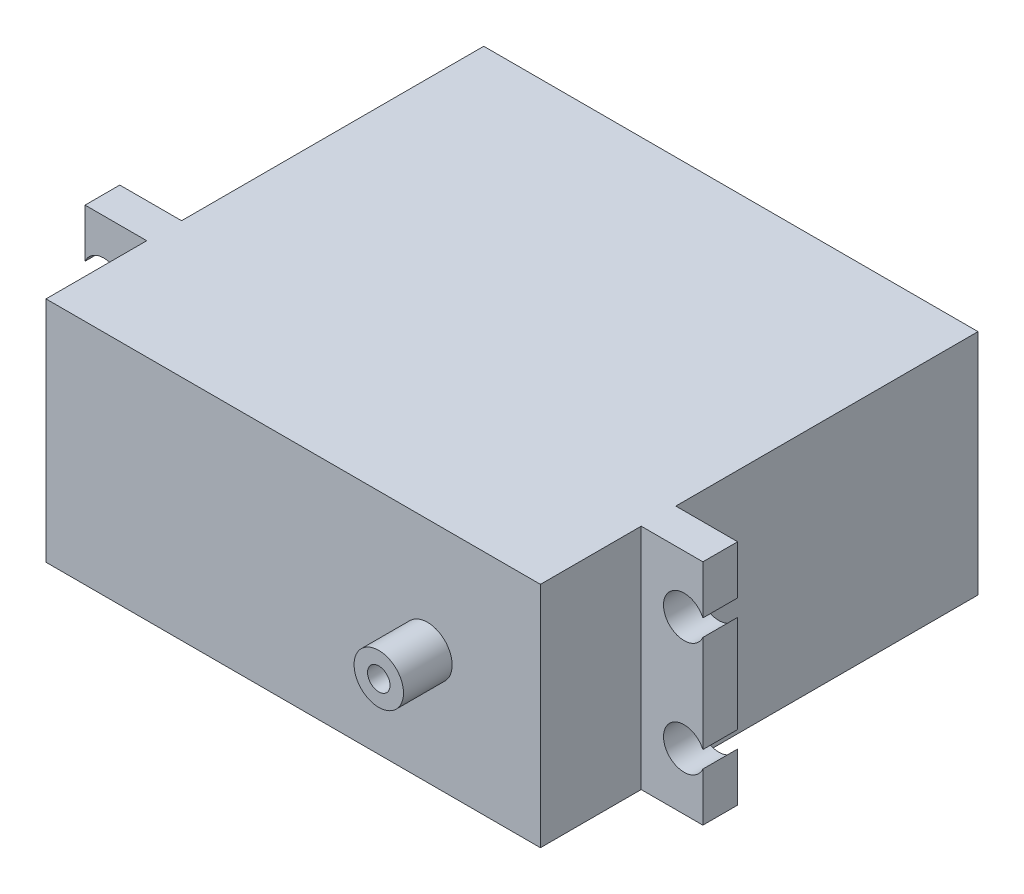
ISO-10303-21;
HEADER;
FILE_DESCRIPTION(('STEP AP214'),'2;1');
FILE_NAME('part.step','',(''),(''),'','','');
FILE_SCHEMA(('AUTOMOTIVE_DESIGN { 1 0 10303 214 1 1 1 1 }'));
ENDSEC;
DATA;
#1=APPLICATION_CONTEXT('core data for automotive mechanical design processes');
#2=APPLICATION_PROTOCOL_DEFINITION('international standard','automotive_design',2000,#1);
#3=PRODUCT_CONTEXT('',#1,'mechanical');
#4=PRODUCT('Part','Part','',(#3));
#5=PRODUCT_RELATED_PRODUCT_CATEGORY('part','',(#4));
#6=PRODUCT_DEFINITION_FORMATION('','',#4);
#7=PRODUCT_DEFINITION_CONTEXT('part definition',#1,'design');
#8=PRODUCT_DEFINITION('design','',#6,#7);
#9=PRODUCT_DEFINITION_SHAPE('','',#8);
#10=(LENGTH_UNIT() NAMED_UNIT(*) SI_UNIT(.MILLI.,.METRE.));
#11=(NAMED_UNIT(*) PLANE_ANGLE_UNIT() SI_UNIT($,.RADIAN.));
#12=(NAMED_UNIT(*) SI_UNIT($,.STERADIAN.) SOLID_ANGLE_UNIT());
#13=UNCERTAINTY_MEASURE_WITH_UNIT(LENGTH_MEASURE(1.E-05),#10,'distance_accuracy_value','');
#14=(GEOMETRIC_REPRESENTATION_CONTEXT(3) GLOBAL_UNCERTAINTY_ASSIGNED_CONTEXT((#13)) GLOBAL_UNIT_ASSIGNED_CONTEXT((#10,
#11,#12)) REPRESENTATION_CONTEXT('',''));
#15=CARTESIAN_POINT('',(0.,0.,0.));
#16=DIRECTION('',(0.,0.,1.));
#17=DIRECTION('',(1.,0.,0.));
#18=AXIS2_PLACEMENT_3D('',#15,#16,#17);
#19=CARTESIAN_POINT('',(0.,0.,45.0154));
#20=DIRECTION('',(0.,0.,1.));
#21=DIRECTION('',(1.,0.,0.));
#22=AXIS2_PLACEMENT_3D('',#19,#20,#21);
#23=PLANE('',#22);
#24=DIRECTION('',(0.,-1.,0.));
#25=VECTOR('',#24,1.);
#26=CARTESIAN_POINT('',(-33.03236,-15.24,45.0154));
#27=LINE('',#26,#25);
#28=CARTESIAN_POINT('',(-33.03236,15.24,45.0154));
#29=VERTEX_POINT('',#28);
#30=CARTESIAN_POINT('',(-33.03236,-15.24,45.0154));
#31=VERTEX_POINT('',#30);
#32=EDGE_CURVE('E194',#29,#31,#27,.T.);
#33=ORIENTED_EDGE('',*,*,#32,.F.);
#34=DIRECTION('',(-1.,0.,0.));
#35=VECTOR('',#34,1.);
#36=CARTESIAN_POINT('',(0.,15.24,45.0154));
#37=LINE('',#36,#35);
#38=CARTESIAN_POINT('',(-41.275,15.24,45.0154));
#39=VERTEX_POINT('',#38);
#40=EDGE_CURVE('E472',#29,#39,#37,.T.);
#41=ORIENTED_EDGE('',*,*,#40,.T.);
#42=DIRECTION('',(0.,1.,0.));
#43=VECTOR('',#42,1.);
#44=CARTESIAN_POINT('',(-41.275,0.,45.0154));
#45=LINE('',#44,#43);
#46=CARTESIAN_POINT('',(-41.275,8.74168445002051,45.0154));
#47=VERTEX_POINT('',#46);
#48=EDGE_CURVE('E480',#47,#39,#45,.T.);
#49=ORIENTED_EDGE('',*,*,#48,.F.);
#50=CARTESIAN_POINT('',(-38.76612,7.61562,45.0154));
#51=DIRECTION('',(0.,0.,1.));
#52=DIRECTION('',(1.,0.,0.));
#53=AXIS2_PLACEMENT_3D('',#50,#51,#52);
#54=CIRCLE('',#53,2.75);
#55=CARTESIAN_POINT('',(-41.275,6.48955554997949,45.0154));
#56=VERTEX_POINT('',#55);
#57=EDGE_CURVE('E492',#47,#56,#54,.F.);
#58=ORIENTED_EDGE('',*,*,#57,.T.);
#59=DIRECTION('',(0.,-1.,0.));
#60=VECTOR('',#59,1.);
#61=CARTESIAN_POINT('',(-41.275,0.,45.0154));
#62=LINE('',#61,#60);
#63=CARTESIAN_POINT('',(-41.275,-6.48955554997949,45.0154));
#64=VERTEX_POINT('',#63);
#65=EDGE_CURVE('E494',#56,#64,#62,.T.);
#66=ORIENTED_EDGE('',*,*,#65,.T.);
#67=CARTESIAN_POINT('',(-38.76612,-7.61562,45.0154));
#68=DIRECTION('',(0.,0.,1.));
#69=DIRECTION('',(1.,0.,0.));
#70=AXIS2_PLACEMENT_3D('',#67,#68,#69);
#71=CIRCLE('',#70,2.75);
#72=CARTESIAN_POINT('',(-41.275,-8.74168445002051,45.0154));
#73=VERTEX_POINT('',#72);
#74=EDGE_CURVE('E496',#73,#64,#71,.T.);
#75=ORIENTED_EDGE('',*,*,#74,.F.);
#76=DIRECTION('',(0.,-1.,0.));
#77=VECTOR('',#76,1.);
#78=CARTESIAN_POINT('',(-41.275,0.,45.0154));
#79=LINE('',#78,#77);
#80=CARTESIAN_POINT('',(-41.275,-15.24,45.0154));
#81=VERTEX_POINT('',#80);
#82=EDGE_CURVE('E499',#73,#81,#79,.T.);
#83=ORIENTED_EDGE('',*,*,#82,.T.);
#84=DIRECTION('',(-1.,0.,0.));
#85=VECTOR('',#84,1.);
#86=CARTESIAN_POINT('',(0.,-15.24,45.0154));
#87=LINE('',#86,#85);
#88=EDGE_CURVE('E50',#31,#81,#87,.T.);
#89=ORIENTED_EDGE('',*,*,#88,.F.);
#90=EDGE_LOOP('',(#33,#41,#49,#58,#66,#75,#83,#89));
#91=FACE_BOUND('',#90,.T.);
#92=ADVANCED_FACE('F35',(#91),#23,.T.);
#93=CARTESIAN_POINT('',(-33.02,-15.24,40.3754));
#94=DIRECTION('',(1.,0.,0.));
#95=DIRECTION('',(0.,0.,-1.));
#96=AXIS2_PLACEMENT_3D('',#93,#94,#95);
#97=PLANE('',#96);
#98=DIRECTION('',(0.,-1.,0.));
#99=VECTOR('',#98,1.);
#100=CARTESIAN_POINT('',(-33.02,-15.24,0.));
#101=LINE('',#100,#99);
#102=CARTESIAN_POINT('',(-33.02,15.24,0.));
#103=VERTEX_POINT('',#102);
#104=CARTESIAN_POINT('',(-33.02,-15.24,0.));
#105=VERTEX_POINT('',#104);
#106=EDGE_CURVE('E560',#103,#105,#101,.T.);
#107=ORIENTED_EDGE('',*,*,#106,.T.);
#108=DIRECTION('',(0.,0.,-1.));
#109=VECTOR('',#108,1.);
#110=CARTESIAN_POINT('',(-33.02,-15.24,40.3754));
#111=LINE('',#110,#109);
#112=CARTESIAN_POINT('',(-33.02,-15.24,40.3754));
#113=VERTEX_POINT('',#112);
#114=EDGE_CURVE('E43',#113,#105,#111,.T.);
#115=ORIENTED_EDGE('',*,*,#114,.F.);
#116=DIRECTION('',(0.,-1.,0.));
#117=VECTOR('',#116,1.);
#118=CARTESIAN_POINT('',(-33.02,-15.24,40.3754));
#119=LINE('',#118,#117);
#120=CARTESIAN_POINT('',(-33.02,15.24,40.3754));
#121=VERTEX_POINT('',#120);
#122=EDGE_CURVE('E576',#121,#113,#119,.T.);
#123=ORIENTED_EDGE('',*,*,#122,.F.);
#124=DIRECTION('',(0.,0.,-1.));
#125=VECTOR('',#124,1.);
#126=CARTESIAN_POINT('',(-33.02,15.24,40.3754));
#127=LINE('',#126,#125);
#128=EDGE_CURVE('E581',#121,#103,#127,.T.);
#129=ORIENTED_EDGE('',*,*,#128,.T.);
#130=EDGE_LOOP('',(#107,#115,#123,#129));
#131=FACE_BOUND('',#130,.T.);
#132=ADVANCED_FACE('F37',(#131),#97,.F.);
#133=CARTESIAN_POINT('',(33.02,-15.24,40.3754));
#134=DIRECTION('',(0.,1.,0.));
#135=DIRECTION('',(-1.,0.,0.));
#136=AXIS2_PLACEMENT_3D('',#133,#134,#135);
#137=PLANE('',#136);
#138=DIRECTION('',(1.,0.,0.));
#139=VECTOR('',#138,1.);
#140=CARTESIAN_POINT('',(33.02,-15.24,0.));
#141=LINE('',#140,#139);
#142=CARTESIAN_POINT('',(33.02,-15.24,0.));
#143=VERTEX_POINT('',#142);
#144=EDGE_CURVE('E564',#105,#143,#141,.T.);
#145=ORIENTED_EDGE('',*,*,#144,.T.);
#146=DIRECTION('',(0.,0.,-1.));
#147=VECTOR('',#146,1.);
#148=CARTESIAN_POINT('',(33.02,-15.24,40.3754));
#149=LINE('',#148,#147);
#150=CARTESIAN_POINT('',(33.02,-15.24,40.3754));
#151=VERTEX_POINT('',#150);
#152=EDGE_CURVE('E580',#151,#143,#149,.T.);
#153=ORIENTED_EDGE('',*,*,#152,.F.);
#154=DIRECTION('',(-1.,0.,0.));
#155=VECTOR('',#154,1.);
#156=CARTESIAN_POINT('',(0.,-15.24,40.3754));
#157=LINE('',#156,#155);
#158=CARTESIAN_POINT('',(41.275,-15.24,40.3754));
#159=VERTEX_POINT('',#158);
#160=EDGE_CURVE('E528',#159,#151,#157,.T.);
#161=ORIENTED_EDGE('',*,*,#160,.F.);
#162=DIRECTION('',(0.,0.,-1.));
#163=VECTOR('',#162,1.);
#164=CARTESIAN_POINT('',(41.275,-15.24,45.0154));
#165=LINE('',#164,#163);
#166=CARTESIAN_POINT('',(41.275,-15.24,45.0154));
#167=VERTEX_POINT('',#166);
#168=EDGE_CURVE('E535',#167,#159,#165,.T.);
#169=ORIENTED_EDGE('',*,*,#168,.F.);
#170=CARTESIAN_POINT('',(33.03236,-15.24,45.0154));
#171=VERTEX_POINT('',#170);
#172=EDGE_CURVE('E486',#167,#171,#87,.T.);
#173=ORIENTED_EDGE('',*,*,#172,.T.);
#174=DIRECTION('',(0.,0.,-1.));
#175=VECTOR('',#174,1.);
#176=CARTESIAN_POINT('',(33.03236,-15.24,58.4774));
#177=LINE('',#176,#175);
#178=CARTESIAN_POINT('',(33.03236,-15.24,58.4774));
#179=VERTEX_POINT('',#178);
#180=EDGE_CURVE('E179',#179,#171,#177,.T.);
#181=ORIENTED_EDGE('',*,*,#180,.F.);
#182=DIRECTION('',(1.,0.,0.));
#183=VECTOR('',#182,1.);
#184=CARTESIAN_POINT('',(33.03236,-15.24,58.4774));
#185=LINE('',#184,#183);
#186=CARTESIAN_POINT('',(-33.03236,-15.24,58.4774));
#187=VERTEX_POINT('',#186);
#188=EDGE_CURVE('E172',#187,#179,#185,.T.);
#189=ORIENTED_EDGE('',*,*,#188,.F.);
#190=DIRECTION('',(0.,0.,-1.));
#191=VECTOR('',#190,1.);
#192=CARTESIAN_POINT('',(-33.03236,-15.24,58.4774));
#193=LINE('',#192,#191);
#194=EDGE_CURVE('E176',#187,#31,#193,.T.);
#195=ORIENTED_EDGE('',*,*,#194,.T.);
#196=ORIENTED_EDGE('',*,*,#88,.T.);
#197=DIRECTION('',(0.,0.,-1.));
#198=VECTOR('',#197,1.);
#199=CARTESIAN_POINT('',(-41.275,-15.24,45.0154));
#200=LINE('',#199,#198);
#201=CARTESIAN_POINT('',(-41.275,-15.24,40.3754));
#202=VERTEX_POINT('',#201);
#203=EDGE_CURVE('E538',#81,#202,#200,.T.);
#204=ORIENTED_EDGE('',*,*,#203,.T.);
#205=EDGE_CURVE('E525',#113,#202,#157,.T.);
#206=ORIENTED_EDGE('',*,*,#205,.F.);
#207=ORIENTED_EDGE('',*,*,#114,.T.);
#208=EDGE_LOOP('',(#145,#153,#161,#169,#173,#181,#189,#195,#196,#204,#206,#207));
#209=FACE_BOUND('',#208,.T.);
#210=ADVANCED_FACE('F174',(#209),#137,.F.);
#211=CARTESIAN_POINT('',(33.02,-15.24,40.3754));
#212=DIRECTION('',(-1.,0.,0.));
#213=DIRECTION('',(0.,0.,1.));
#214=AXIS2_PLACEMENT_3D('',#211,#212,#213);
#215=PLANE('',#214);
#216=DIRECTION('',(0.,1.,0.));
#217=VECTOR('',#216,1.);
#218=CARTESIAN_POINT('',(33.02,-15.24,0.));
#219=LINE('',#218,#217);
#220=CARTESIAN_POINT('',(33.02,15.24,0.));
#221=VERTEX_POINT('',#220);
#222=EDGE_CURVE('E568',#143,#221,#219,.T.);
#223=ORIENTED_EDGE('',*,*,#222,.T.);
#224=DIRECTION('',(0.,0.,-1.));
#225=VECTOR('',#224,1.);
#226=CARTESIAN_POINT('',(33.02,15.24,40.3754));
#227=LINE('',#226,#225);
#228=CARTESIAN_POINT('',(33.02,15.24,40.3754));
#229=VERTEX_POINT('',#228);
#230=EDGE_CURVE('E577',#229,#221,#227,.T.);
#231=ORIENTED_EDGE('',*,*,#230,.F.);
#232=DIRECTION('',(0.,1.,0.));
#233=VECTOR('',#232,1.);
#234=CARTESIAN_POINT('',(33.02,-15.24,40.3754));
#235=LINE('',#234,#233);
#236=EDGE_CURVE('E584',#151,#229,#235,.T.);
#237=ORIENTED_EDGE('',*,*,#236,.F.);
#238=ORIENTED_EDGE('',*,*,#152,.T.);
#239=EDGE_LOOP('',(#223,#231,#237,#238));
#240=FACE_BOUND('',#239,.T.);
#241=ADVANCED_FACE('F325',(#240),#215,.F.);
#242=CARTESIAN_POINT('',(33.02,15.24,40.3754));
#243=DIRECTION('',(0.,-1.,0.));
#244=DIRECTION('',(1.,0.,0.));
#245=AXIS2_PLACEMENT_3D('',#242,#243,#244);
#246=PLANE('',#245);
#247=DIRECTION('',(-1.,0.,0.));
#248=VECTOR('',#247,1.);
#249=CARTESIAN_POINT('',(33.02,15.24,0.));
#250=LINE('',#249,#248);
#251=EDGE_CURVE('E574',#221,#103,#250,.T.);
#252=ORIENTED_EDGE('',*,*,#251,.T.);
#253=ORIENTED_EDGE('',*,*,#128,.F.);
#254=DIRECTION('',(-1.,0.,0.));
#255=VECTOR('',#254,1.);
#256=CARTESIAN_POINT('',(0.,15.24,40.3754));
#257=LINE('',#256,#255);
#258=CARTESIAN_POINT('',(-41.275,15.24,40.3754));
#259=VERTEX_POINT('',#258);
#260=EDGE_CURVE('E513',#121,#259,#257,.T.);
#261=ORIENTED_EDGE('',*,*,#260,.T.);
#262=DIRECTION('',(0.,0.,-1.));
#263=VECTOR('',#262,1.);
#264=CARTESIAN_POINT('',(-41.275,15.24,45.0154));
#265=LINE('',#264,#263);
#266=EDGE_CURVE('E474',#39,#259,#265,.T.);
#267=ORIENTED_EDGE('',*,*,#266,.F.);
#268=ORIENTED_EDGE('',*,*,#40,.F.);
#269=DIRECTION('',(0.,0.,-1.));
#270=VECTOR('',#269,1.);
#271=CARTESIAN_POINT('',(-33.03236,15.24,58.4774));
#272=LINE('',#271,#270);
#273=CARTESIAN_POINT('',(-33.03236,15.24,58.4774));
#274=VERTEX_POINT('',#273);
#275=EDGE_CURVE('E210',#274,#29,#272,.T.);
#276=ORIENTED_EDGE('',*,*,#275,.F.);
#277=DIRECTION('',(-1.,0.,0.));
#278=VECTOR('',#277,1.);
#279=CARTESIAN_POINT('',(33.03236,15.24,58.4774));
#280=LINE('',#279,#278);
#281=CARTESIAN_POINT('',(33.03236,15.24,58.4774));
#282=VERTEX_POINT('',#281);
#283=EDGE_CURVE('E188',#282,#274,#280,.T.);
#284=ORIENTED_EDGE('',*,*,#283,.F.);
#285=DIRECTION('',(0.,0.,-1.));
#286=VECTOR('',#285,1.);
#287=CARTESIAN_POINT('',(33.03236,15.24,58.4774));
#288=LINE('',#287,#286);
#289=CARTESIAN_POINT('',(33.03236,15.24,45.0154));
#290=VERTEX_POINT('',#289);
#291=EDGE_CURVE('E200',#282,#290,#288,.T.);
#292=ORIENTED_EDGE('',*,*,#291,.T.);
#293=CARTESIAN_POINT('',(41.275,15.24,45.0154));
#294=VERTEX_POINT('',#293);
#295=EDGE_CURVE('E477',#294,#290,#37,.T.);
#296=ORIENTED_EDGE('',*,*,#295,.F.);
#297=DIRECTION('',(0.,0.,-1.));
#298=VECTOR('',#297,1.);
#299=CARTESIAN_POINT('',(41.275,15.24,45.0154));
#300=LINE('',#299,#298);
#301=CARTESIAN_POINT('',(41.275,15.24,40.3754));
#302=VERTEX_POINT('',#301);
#303=EDGE_CURVE('E551',#294,#302,#300,.T.);
#304=ORIENTED_EDGE('',*,*,#303,.T.);
#305=EDGE_CURVE('E522',#302,#229,#257,.T.);
#306=ORIENTED_EDGE('',*,*,#305,.T.);
#307=ORIENTED_EDGE('',*,*,#230,.T.);
#308=EDGE_LOOP('',(#252,#253,#261,#267,#268,#276,#284,#292,#296,#304,#306,#307));
#309=FACE_BOUND('',#308,.T.);
#310=ADVANCED_FACE('F321',(#309),#246,.F.);
#311=CARTESIAN_POINT('',(0.,0.,0.));
#312=DIRECTION('',(0.,0.,1.));
#313=DIRECTION('',(1.,0.,0.));
#314=AXIS2_PLACEMENT_3D('',#311,#312,#313);
#315=PLANE('',#314);
#316=ORIENTED_EDGE('',*,*,#106,.F.);
#317=ORIENTED_EDGE('',*,*,#251,.F.);
#318=ORIENTED_EDGE('',*,*,#222,.F.);
#319=ORIENTED_EDGE('',*,*,#144,.F.);
#320=EDGE_LOOP('',(#316,#317,#318,#319));
#321=FACE_BOUND('',#320,.T.);
#322=ADVANCED_FACE('F318',(#321),#315,.F.);
#323=CARTESIAN_POINT('',(0.,0.,40.3754));
#324=DIRECTION('',(0.,0.,1.));
#325=DIRECTION('',(1.,0.,0.));
#326=AXIS2_PLACEMENT_3D('',#323,#324,#325);
#327=PLANE('',#326);
#328=ORIENTED_EDGE('',*,*,#260,.F.);
#329=ORIENTED_EDGE('',*,*,#122,.T.);
#330=ORIENTED_EDGE('',*,*,#205,.T.);
#331=DIRECTION('',(0.,-1.,0.));
#332=VECTOR('',#331,1.);
#333=CARTESIAN_POINT('',(-41.275,0.,40.3754));
#334=LINE('',#333,#332);
#335=CARTESIAN_POINT('',(-41.275,-8.74168445002051,40.3754));
#336=VERTEX_POINT('',#335);
#337=EDGE_CURVE('E529',#336,#202,#334,.T.);
#338=ORIENTED_EDGE('',*,*,#337,.F.);
#339=CARTESIAN_POINT('',(-38.76612,-7.61562,40.3754));
#340=DIRECTION('',(0.,0.,1.));
#341=DIRECTION('',(1.,0.,0.));
#342=AXIS2_PLACEMENT_3D('',#339,#340,#341);
#343=CIRCLE('',#342,2.75);
#344=CARTESIAN_POINT('',(-41.275,-6.48955554997949,40.3754));
#345=VERTEX_POINT('',#344);
#346=EDGE_CURVE('E641',#336,#345,#343,.T.);
#347=ORIENTED_EDGE('',*,*,#346,.T.);
#348=DIRECTION('',(0.,-1.,0.));
#349=VECTOR('',#348,1.);
#350=CARTESIAN_POINT('',(-41.275,0.,40.3754));
#351=LINE('',#350,#349);
#352=CARTESIAN_POINT('',(-41.275,6.48955554997949,40.3754));
#353=VERTEX_POINT('',#352);
#354=EDGE_CURVE('E616',#353,#345,#351,.T.);
#355=ORIENTED_EDGE('',*,*,#354,.F.);
#356=CARTESIAN_POINT('',(-38.76612,7.61562,40.3754));
#357=DIRECTION('',(0.,0.,1.));
#358=DIRECTION('',(1.,0.,0.));
#359=AXIS2_PLACEMENT_3D('',#356,#357,#358);
#360=CIRCLE('',#359,2.75);
#361=CARTESIAN_POINT('',(-41.275,8.74168445002051,40.3754));
#362=VERTEX_POINT('',#361);
#363=EDGE_CURVE('E613',#362,#353,#360,.F.);
#364=ORIENTED_EDGE('',*,*,#363,.F.);
#365=DIRECTION('',(0.,1.,0.));
#366=VECTOR('',#365,1.);
#367=CARTESIAN_POINT('',(-41.275,0.,40.3754));
#368=LINE('',#367,#366);
#369=EDGE_CURVE('E516',#362,#259,#368,.T.);
#370=ORIENTED_EDGE('',*,*,#369,.T.);
#371=EDGE_LOOP('',(#328,#329,#330,#338,#347,#355,#364,#370));
#372=FACE_BOUND('',#371,.T.);
#373=ADVANCED_FACE('F284',(#372),#327,.F.);
#374=ORIENTED_EDGE('',*,*,#160,.T.);
#375=ORIENTED_EDGE('',*,*,#236,.T.);
#376=ORIENTED_EDGE('',*,*,#305,.F.);
#377=DIRECTION('',(0.,1.,0.));
#378=VECTOR('',#377,1.);
#379=CARTESIAN_POINT('',(41.275,0.,40.3754));
#380=LINE('',#379,#378);
#381=CARTESIAN_POINT('',(41.275,8.7416844500205,40.3754));
#382=VERTEX_POINT('',#381);
#383=EDGE_CURVE('E511',#382,#302,#380,.T.);
#384=ORIENTED_EDGE('',*,*,#383,.F.);
#385=CARTESIAN_POINT('',(38.76612,7.61562000000001,40.3754));
#386=DIRECTION('',(0.,0.,1.));
#387=DIRECTION('',(1.,0.,0.));
#388=AXIS2_PLACEMENT_3D('',#385,#386,#387);
#389=CIRCLE('',#388,2.75);
#390=CARTESIAN_POINT('',(41.275,6.4895555499795,40.3754));
#391=VERTEX_POINT('',#390);
#392=EDGE_CURVE('E508',#382,#391,#389,.T.);
#393=ORIENTED_EDGE('',*,*,#392,.T.);
#394=DIRECTION('',(0.,-1.,0.));
#395=VECTOR('',#394,1.);
#396=CARTESIAN_POINT('',(41.275,0.,40.3754));
#397=LINE('',#396,#395);
#398=CARTESIAN_POINT('',(41.275,-6.4895555499795,40.3754));
#399=VERTEX_POINT('',#398);
#400=EDGE_CURVE('E505',#391,#399,#397,.T.);
#401=ORIENTED_EDGE('',*,*,#400,.T.);
#402=CARTESIAN_POINT('',(38.76612,-7.61562000000001,40.3754));
#403=DIRECTION('',(0.,0.,1.));
#404=DIRECTION('',(1.,0.,0.));
#405=AXIS2_PLACEMENT_3D('',#402,#403,#404);
#406=CIRCLE('',#405,2.75);
#407=CARTESIAN_POINT('',(41.275,-8.7416844500205,40.3754));
#408=VERTEX_POINT('',#407);
#409=EDGE_CURVE('E198',#408,#399,#406,.F.);
#410=ORIENTED_EDGE('',*,*,#409,.F.);
#411=DIRECTION('',(0.,-1.,0.));
#412=VECTOR('',#411,1.);
#413=CARTESIAN_POINT('',(41.275,0.,40.3754));
#414=LINE('',#413,#412);
#415=EDGE_CURVE('E195',#408,#159,#414,.T.);
#416=ORIENTED_EDGE('',*,*,#415,.T.);
#417=EDGE_LOOP('',(#374,#375,#376,#384,#393,#401,#410,#416));
#418=FACE_BOUND('',#417,.T.);
#419=ADVANCED_FACE('F316',(#418),#327,.F.);
#420=CARTESIAN_POINT('',(41.275,0.,45.0154));
#421=DIRECTION('',(1.,0.,0.));
#422=DIRECTION('',(0.,0.,-1.));
#423=AXIS2_PLACEMENT_3D('',#420,#421,#422);
#424=PLANE('',#423);
#425=ORIENTED_EDGE('',*,*,#415,.F.);
#426=DIRECTION('',(0.,0.,-1.));
#427=VECTOR('',#426,1.);
#428=CARTESIAN_POINT('',(41.275,-8.7416844500205,45.0154));
#429=LINE('',#428,#427);
#430=CARTESIAN_POINT('',(41.275,-8.7416844500205,45.0154));
#431=VERTEX_POINT('',#430);
#432=EDGE_CURVE('E559',#431,#408,#429,.T.);
#433=ORIENTED_EDGE('',*,*,#432,.F.);
#434=DIRECTION('',(0.,-1.,0.));
#435=VECTOR('',#434,1.);
#436=CARTESIAN_POINT('',(41.275,0.,45.0154));
#437=LINE('',#436,#435);
#438=EDGE_CURVE('E217',#431,#167,#437,.T.);
#439=ORIENTED_EDGE('',*,*,#438,.T.);
#440=ORIENTED_EDGE('',*,*,#168,.T.);
#441=EDGE_LOOP('',(#425,#433,#439,#440));
#442=FACE_BOUND('',#441,.T.);
#443=ADVANCED_FACE('F312',(#442),#424,.T.);
#444=CARTESIAN_POINT('',(38.76612,-7.61562000000001,45.0154));
#445=DIRECTION('',(0.,0.,-1.));
#446=DIRECTION('',(-1.,0.,0.));
#447=AXIS2_PLACEMENT_3D('',#444,#445,#446);
#448=CYLINDRICAL_SURFACE('',#447,2.75);
#449=ORIENTED_EDGE('',*,*,#409,.T.);
#450=DIRECTION('',(0.,0.,-1.));
#451=VECTOR('',#450,1.);
#452=CARTESIAN_POINT('',(41.275,-6.4895555499795,45.0154));
#453=LINE('',#452,#451);
#454=CARTESIAN_POINT('',(41.275,-6.4895555499795,45.0154));
#455=VERTEX_POINT('',#454);
#456=EDGE_CURVE('E558',#455,#399,#453,.T.);
#457=ORIENTED_EDGE('',*,*,#456,.F.);
#458=CARTESIAN_POINT('',(38.76612,-7.61562000000001,45.0154));
#459=DIRECTION('',(0.,0.,1.));
#460=DIRECTION('',(1.,0.,0.));
#461=AXIS2_PLACEMENT_3D('',#458,#459,#460);
#462=CIRCLE('',#461,2.75);
#463=EDGE_CURVE('E625',#431,#455,#462,.F.);
#464=ORIENTED_EDGE('',*,*,#463,.F.);
#465=ORIENTED_EDGE('',*,*,#432,.T.);
#466=EDGE_LOOP('',(#449,#457,#464,#465));
#467=FACE_BOUND('',#466,.T.);
#468=ADVANCED_FACE('F308',(#467),#448,.F.);
#469=CARTESIAN_POINT('',(41.275,0.,45.0154));
#470=DIRECTION('',(1.,0.,0.));
#471=DIRECTION('',(0.,0.,-1.));
#472=AXIS2_PLACEMENT_3D('',#469,#470,#471);
#473=PLANE('',#472);
#474=ORIENTED_EDGE('',*,*,#400,.F.);
#475=DIRECTION('',(0.,0.,-1.));
#476=VECTOR('',#475,1.);
#477=CARTESIAN_POINT('',(41.275,6.4895555499795,45.0154));
#478=LINE('',#477,#476);
#479=CARTESIAN_POINT('',(41.275,6.4895555499795,45.0154));
#480=VERTEX_POINT('',#479);
#481=EDGE_CURVE('E556',#480,#391,#478,.T.);
#482=ORIENTED_EDGE('',*,*,#481,.F.);
#483=DIRECTION('',(0.,-1.,0.));
#484=VECTOR('',#483,1.);
#485=CARTESIAN_POINT('',(41.275,0.,45.0154));
#486=LINE('',#485,#484);
#487=EDGE_CURVE('E627',#480,#455,#486,.T.);
#488=ORIENTED_EDGE('',*,*,#487,.T.);
#489=ORIENTED_EDGE('',*,*,#456,.T.);
#490=EDGE_LOOP('',(#474,#482,#488,#489));
#491=FACE_BOUND('',#490,.T.);
#492=ADVANCED_FACE('F304',(#491),#473,.T.);
#493=CARTESIAN_POINT('',(38.76612,7.61562000000001,45.0154));
#494=DIRECTION('',(0.,0.,-1.));
#495=DIRECTION('',(-1.,0.,0.));
#496=AXIS2_PLACEMENT_3D('',#493,#494,#495);
#497=CYLINDRICAL_SURFACE('',#496,2.75);
#498=ORIENTED_EDGE('',*,*,#392,.F.);
#499=DIRECTION('',(0.,0.,-1.));
#500=VECTOR('',#499,1.);
#501=CARTESIAN_POINT('',(41.275,8.7416844500205,45.0154));
#502=LINE('',#501,#500);
#503=CARTESIAN_POINT('',(41.275,8.7416844500205,45.0154));
#504=VERTEX_POINT('',#503);
#505=EDGE_CURVE('E554',#504,#382,#502,.T.);
#506=ORIENTED_EDGE('',*,*,#505,.F.);
#507=CARTESIAN_POINT('',(38.76612,7.61562000000001,45.0154));
#508=DIRECTION('',(0.,0.,1.));
#509=DIRECTION('',(1.,0.,0.));
#510=AXIS2_PLACEMENT_3D('',#507,#508,#509);
#511=CIRCLE('',#510,2.75);
#512=EDGE_CURVE('E482',#504,#480,#511,.T.);
#513=ORIENTED_EDGE('',*,*,#512,.T.);
#514=ORIENTED_EDGE('',*,*,#481,.T.);
#515=EDGE_LOOP('',(#498,#506,#513,#514));
#516=FACE_BOUND('',#515,.T.);
#517=ADVANCED_FACE('F300',(#516),#497,.F.);
#518=CARTESIAN_POINT('',(41.275,0.,45.0154));
#519=DIRECTION('',(-1.,0.,0.));
#520=DIRECTION('',(0.,0.,1.));
#521=AXIS2_PLACEMENT_3D('',#518,#519,#520);
#522=PLANE('',#521);
#523=ORIENTED_EDGE('',*,*,#383,.T.);
#524=ORIENTED_EDGE('',*,*,#303,.F.);
#525=DIRECTION('',(0.,1.,0.));
#526=VECTOR('',#525,1.);
#527=CARTESIAN_POINT('',(41.275,0.,45.0154));
#528=LINE('',#527,#526);
#529=EDGE_CURVE('E478',#504,#294,#528,.T.);
#530=ORIENTED_EDGE('',*,*,#529,.F.);
#531=ORIENTED_EDGE('',*,*,#505,.T.);
#532=EDGE_LOOP('',(#523,#524,#530,#531));
#533=FACE_BOUND('',#532,.T.);
#534=ADVANCED_FACE('F296',(#533),#522,.F.);
#535=CARTESIAN_POINT('',(-41.275,0.,45.0154));
#536=DIRECTION('',(-1.,0.,0.));
#537=DIRECTION('',(0.,0.,1.));
#538=AXIS2_PLACEMENT_3D('',#535,#536,#537);
#539=PLANE('',#538);
#540=ORIENTED_EDGE('',*,*,#369,.F.);
#541=DIRECTION('',(0.,0.,-1.));
#542=VECTOR('',#541,1.);
#543=CARTESIAN_POINT('',(-41.275,8.74168445002051,45.0154));
#544=LINE('',#543,#542);
#545=EDGE_CURVE('E548',#47,#362,#544,.T.);
#546=ORIENTED_EDGE('',*,*,#545,.F.);
#547=ORIENTED_EDGE('',*,*,#48,.T.);
#548=ORIENTED_EDGE('',*,*,#266,.T.);
#549=EDGE_LOOP('',(#540,#546,#547,#548));
#550=FACE_BOUND('',#549,.T.);
#551=ADVANCED_FACE('F292',(#550),#539,.T.);
#552=CARTESIAN_POINT('',(-38.76612,7.61562,45.0154));
#553=DIRECTION('',(0.,0.,-1.));
#554=DIRECTION('',(-1.,0.,0.));
#555=AXIS2_PLACEMENT_3D('',#552,#553,#554);
#556=CYLINDRICAL_SURFACE('',#555,2.75);
#557=ORIENTED_EDGE('',*,*,#363,.T.);
#558=DIRECTION('',(0.,0.,-1.));
#559=VECTOR('',#558,1.);
#560=CARTESIAN_POINT('',(-41.275,6.48955554997949,45.0154));
#561=LINE('',#560,#559);
#562=EDGE_CURVE('E545',#56,#353,#561,.T.);
#563=ORIENTED_EDGE('',*,*,#562,.F.);
#564=ORIENTED_EDGE('',*,*,#57,.F.);
#565=ORIENTED_EDGE('',*,*,#545,.T.);
#566=EDGE_LOOP('',(#557,#563,#564,#565));
#567=FACE_BOUND('',#566,.T.);
#568=ADVANCED_FACE('F288',(#567),#556,.F.);
#569=CARTESIAN_POINT('',(-41.275,0.,45.0154));
#570=DIRECTION('',(1.,0.,0.));
#571=DIRECTION('',(0.,0.,-1.));
#572=AXIS2_PLACEMENT_3D('',#569,#570,#571);
#573=PLANE('',#572);
#574=ORIENTED_EDGE('',*,*,#354,.T.);
#575=DIRECTION('',(0.,0.,-1.));
#576=VECTOR('',#575,1.);
#577=CARTESIAN_POINT('',(-41.275,-6.48955554997949,45.0154));
#578=LINE('',#577,#576);
#579=EDGE_CURVE('E543',#64,#345,#578,.T.);
#580=ORIENTED_EDGE('',*,*,#579,.F.);
#581=ORIENTED_EDGE('',*,*,#65,.F.);
#582=ORIENTED_EDGE('',*,*,#562,.T.);
#583=EDGE_LOOP('',(#574,#580,#581,#582));
#584=FACE_BOUND('',#583,.T.);
#585=ADVANCED_FACE('F280',(#584),#573,.F.);
#586=CARTESIAN_POINT('',(-38.76612,-7.61562,45.0154));
#587=DIRECTION('',(0.,0.,-1.));
#588=DIRECTION('',(-1.,0.,0.));
#589=AXIS2_PLACEMENT_3D('',#586,#587,#588);
#590=CYLINDRICAL_SURFACE('',#589,2.75);
#591=ORIENTED_EDGE('',*,*,#346,.F.);
#592=DIRECTION('',(0.,0.,-1.));
#593=VECTOR('',#592,1.);
#594=CARTESIAN_POINT('',(-41.275,-8.74168445002051,45.0154));
#595=LINE('',#594,#593);
#596=EDGE_CURVE('E541',#73,#336,#595,.T.);
#597=ORIENTED_EDGE('',*,*,#596,.F.);
#598=ORIENTED_EDGE('',*,*,#74,.T.);
#599=ORIENTED_EDGE('',*,*,#579,.T.);
#600=EDGE_LOOP('',(#591,#597,#598,#599));
#601=FACE_BOUND('',#600,.T.);
#602=ADVANCED_FACE('F274',(#601),#590,.F.);
#603=CARTESIAN_POINT('',(-41.275,0.,45.0154));
#604=DIRECTION('',(1.,0.,0.));
#605=DIRECTION('',(0.,0.,-1.));
#606=AXIS2_PLACEMENT_3D('',#603,#604,#605);
#607=PLANE('',#606);
#608=ORIENTED_EDGE('',*,*,#337,.T.);
#609=ORIENTED_EDGE('',*,*,#203,.F.);
#610=ORIENTED_EDGE('',*,*,#82,.F.);
#611=ORIENTED_EDGE('',*,*,#596,.T.);
#612=EDGE_LOOP('',(#608,#609,#610,#611));
#613=FACE_BOUND('',#612,.T.);
#614=ADVANCED_FACE('F269',(#613),#607,.F.);
#615=DIRECTION('',(0.,1.,0.));
#616=VECTOR('',#615,1.);
#617=CARTESIAN_POINT('',(33.03236,-15.24,45.0154));
#618=LINE('',#617,#616);
#619=EDGE_CURVE('E58',#171,#290,#618,.T.);
#620=ORIENTED_EDGE('',*,*,#619,.F.);
#621=ORIENTED_EDGE('',*,*,#172,.F.);
#622=ORIENTED_EDGE('',*,*,#438,.F.);
#623=ORIENTED_EDGE('',*,*,#463,.T.);
#624=ORIENTED_EDGE('',*,*,#487,.F.);
#625=ORIENTED_EDGE('',*,*,#512,.F.);
#626=ORIENTED_EDGE('',*,*,#529,.T.);
#627=ORIENTED_EDGE('',*,*,#295,.T.);
#628=EDGE_LOOP('',(#620,#621,#622,#623,#624,#625,#626,#627));
#629=FACE_BOUND('',#628,.T.);
#630=ADVANCED_FACE('F261',(#629),#23,.T.);
#631=CARTESIAN_POINT('',(-33.03236,-15.24,58.4774));
#632=DIRECTION('',(1.,0.,0.));
#633=DIRECTION('',(0.,0.,-1.));
#634=AXIS2_PLACEMENT_3D('',#631,#632,#633);
#635=PLANE('',#634);
#636=ORIENTED_EDGE('',*,*,#32,.T.);
#637=ORIENTED_EDGE('',*,*,#194,.F.);
#638=DIRECTION('',(0.,-1.,0.));
#639=VECTOR('',#638,1.);
#640=CARTESIAN_POINT('',(-33.03236,-15.24,58.4774));
#641=LINE('',#640,#639);
#642=EDGE_CURVE('E183',#274,#187,#641,.T.);
#643=ORIENTED_EDGE('',*,*,#642,.F.);
#644=ORIENTED_EDGE('',*,*,#275,.T.);
#645=EDGE_LOOP('',(#636,#637,#643,#644));
#646=FACE_BOUND('',#645,.T.);
#647=ADVANCED_FACE('F193',(#646),#635,.F.);
#648=CARTESIAN_POINT('',(33.03236,-15.24,58.4774));
#649=DIRECTION('',(-1.,0.,0.));
#650=DIRECTION('',(0.,0.,1.));
#651=AXIS2_PLACEMENT_3D('',#648,#649,#650);
#652=PLANE('',#651);
#653=ORIENTED_EDGE('',*,*,#619,.T.);
#654=ORIENTED_EDGE('',*,*,#291,.F.);
#655=DIRECTION('',(0.,1.,0.));
#656=VECTOR('',#655,1.);
#657=CARTESIAN_POINT('',(33.03236,-15.24,58.4774));
#658=LINE('',#657,#656);
#659=EDGE_CURVE('E182',#179,#282,#658,.T.);
#660=ORIENTED_EDGE('',*,*,#659,.F.);
#661=ORIENTED_EDGE('',*,*,#180,.T.);
#662=EDGE_LOOP('',(#653,#654,#660,#661));
#663=FACE_BOUND('',#662,.T.);
#664=ADVANCED_FACE('F254',(#663),#652,.F.);
#665=CARTESIAN_POINT('',(0.,0.,58.4774));
#666=DIRECTION('',(0.,0.,1.));
#667=DIRECTION('',(1.,0.,0.));
#668=AXIS2_PLACEMENT_3D('',#665,#666,#667);
#669=PLANE('',#668);
#670=CARTESIAN_POINT('',(17.9325,0.,58.4774));
#671=DIRECTION('',(0.,0.,1.));
#672=DIRECTION('',(1.,0.,0.));
#673=AXIS2_PLACEMENT_3D('',#670,#671,#672);
#674=CIRCLE('',#673,3.302);
#675=CARTESIAN_POINT('',(21.2345,0.,58.4774));
#676=VERTEX_POINT('',#675);
#677=EDGE_CURVE('E231',#676,#676,#674,.T.);
#678=ORIENTED_EDGE('',*,*,#677,.F.);
#679=EDGE_LOOP('',(#678));
#680=FACE_BOUND('',#679,.T.);
#681=ORIENTED_EDGE('',*,*,#642,.T.);
#682=ORIENTED_EDGE('',*,*,#188,.T.);
#683=ORIENTED_EDGE('',*,*,#659,.T.);
#684=ORIENTED_EDGE('',*,*,#283,.T.);
#685=EDGE_LOOP('',(#681,#682,#683,#684));
#686=FACE_BOUND('',#685,.T.);
#687=ADVANCED_FACE('F186',(#680,#686),#669,.T.);
#688=CARTESIAN_POINT('',(17.9325,0.,64.9774));
#689=DIRECTION('',(0.,0.,1.));
#690=DIRECTION('',(1.,0.,0.));
#691=AXIS2_PLACEMENT_3D('',#688,#689,#690);
#692=PLANE('',#691);
#693=CARTESIAN_POINT('',(17.9325,0.,64.9774));
#694=DIRECTION('',(0.,0.,1.));
#695=DIRECTION('',(1.,0.,0.));
#696=AXIS2_PLACEMENT_3D('',#693,#694,#695);
#697=CIRCLE('',#696,3.302);
#698=CARTESIAN_POINT('',(21.2345,0.,64.9774));
#699=VERTEX_POINT('',#698);
#700=EDGE_CURVE('E209',#699,#699,#697,.T.);
#701=ORIENTED_EDGE('',*,*,#700,.T.);
#702=EDGE_LOOP('',(#701));
#703=FACE_BOUND('',#702,.T.);
#704=CARTESIAN_POINT('',(17.9325,0.,64.9774));
#705=DIRECTION('',(0.,0.,1.));
#706=DIRECTION('',(1.,0.,0.));
#707=AXIS2_PLACEMENT_3D('',#704,#705,#706);
#708=CIRCLE('',#707,1.5);
#709=CARTESIAN_POINT('',(19.4325,0.,64.9774));
#710=VERTEX_POINT('',#709);
#711=EDGE_CURVE('E234',#710,#710,#708,.T.);
#712=ORIENTED_EDGE('',*,*,#711,.F.);
#713=EDGE_LOOP('',(#712));
#714=FACE_BOUND('',#713,.T.);
#715=ADVANCED_FACE('F243',(#703,#714),#692,.T.);
#716=CARTESIAN_POINT('',(17.9325,0.,64.9774));
#717=DIRECTION('',(0.,0.,-1.));
#718=DIRECTION('',(-1.,0.,0.));
#719=AXIS2_PLACEMENT_3D('',#716,#717,#718);
#720=CYLINDRICAL_SURFACE('',#719,3.302);
#721=ORIENTED_EDGE('',*,*,#700,.F.);
#722=EDGE_LOOP('',(#721));
#723=FACE_BOUND('',#722,.T.);
#724=ORIENTED_EDGE('',*,*,#677,.T.);
#725=EDGE_LOOP('',(#724));
#726=FACE_BOUND('',#725,.T.);
#727=ADVANCED_FACE('F245',(#723,#726),#720,.T.);
#728=CARTESIAN_POINT('',(17.9325,0.,64.9774));
#729=DIRECTION('',(0.,0.,-1.));
#730=DIRECTION('',(-1.,0.,0.));
#731=AXIS2_PLACEMENT_3D('',#728,#729,#730);
#732=CYLINDRICAL_SURFACE('',#731,1.5);
#733=ORIENTED_EDGE('',*,*,#711,.T.);
#734=EDGE_LOOP('',(#733));
#735=FACE_BOUND('',#734,.T.);
#736=CARTESIAN_POINT('',(17.9325,0.,58.4774));
#737=DIRECTION('',(0.,0.,1.));
#738=DIRECTION('',(1.,0.,0.));
#739=AXIS2_PLACEMENT_3D('',#736,#737,#738);
#740=CIRCLE('',#739,1.5);
#741=CARTESIAN_POINT('',(19.4325,0.,58.4774));
#742=VERTEX_POINT('',#741);
#743=EDGE_CURVE('E11',#742,#742,#740,.F.);
#744=ORIENTED_EDGE('',*,*,#743,.T.);
#745=EDGE_LOOP('',(#744));
#746=FACE_BOUND('',#745,.T.);
#747=ADVANCED_FACE('F240',(#735,#746),#732,.F.);
#748=ORIENTED_EDGE('',*,*,#743,.F.);
#749=EDGE_LOOP('',(#748));
#750=FACE_BOUND('',#749,.T.);
#751=ADVANCED_FACE('F257',(#750),#669,.T.);
#752=CLOSED_SHELL('',(#92,#132,#210,#241,#310,#322,#373,#419,#443,#468,#492,#517,#534,#551,#568,
#585,#602,#614,#630,#647,#664,#687,#715,#727,#747,#751));
#753=MANIFOLD_SOLID_BREP('B2',#752);
#754=ADVANCED_BREP_SHAPE_REPRESENTATION('',(#18,#753),#14);
#755=SHAPE_DEFINITION_REPRESENTATION(#9,#754);
ENDSEC;
END-ISO-10303-21;
